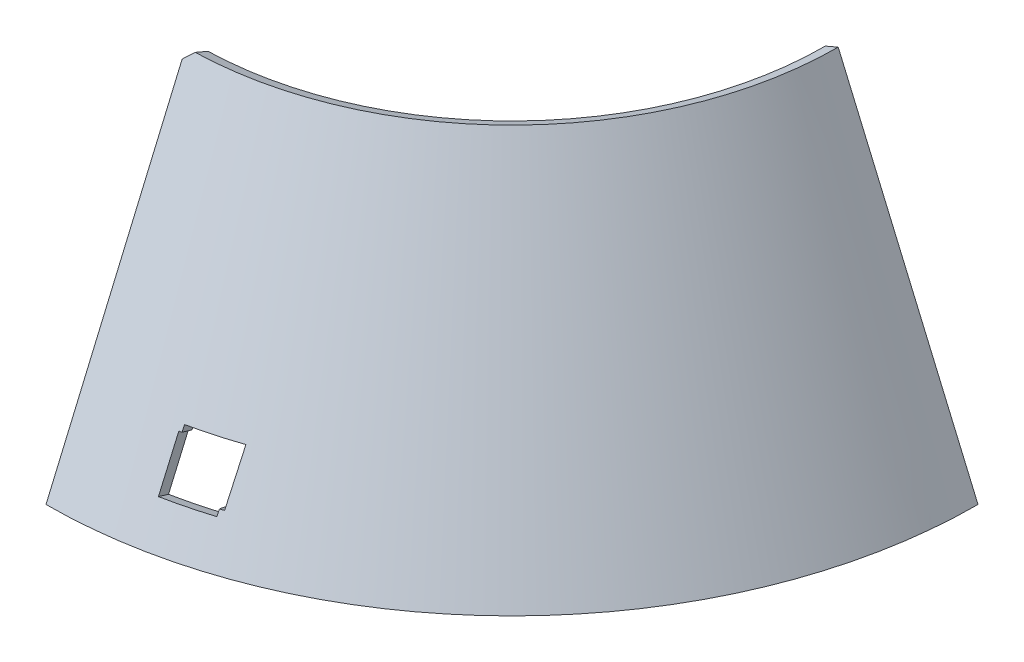
ISO-10303-21;
HEADER;
FILE_DESCRIPTION(('STEP AP214'),'2;1');
FILE_NAME('part.step','',(''),(''),'','','');
FILE_SCHEMA(('AUTOMOTIVE_DESIGN { 1 0 10303 214 1 1 1 1 }'));
ENDSEC;
DATA;
#1=APPLICATION_CONTEXT('core data for automotive mechanical design processes');
#2=APPLICATION_PROTOCOL_DEFINITION('international standard','automotive_design',2000,#1);
#3=PRODUCT_CONTEXT('',#1,'mechanical');
#4=PRODUCT('Part','Part','',(#3));
#5=PRODUCT_RELATED_PRODUCT_CATEGORY('part','',(#4));
#6=PRODUCT_DEFINITION_FORMATION('','',#4);
#7=PRODUCT_DEFINITION_CONTEXT('part definition',#1,'design');
#8=PRODUCT_DEFINITION('design','',#6,#7);
#9=PRODUCT_DEFINITION_SHAPE('','',#8);
#10=(LENGTH_UNIT() NAMED_UNIT(*) SI_UNIT(.MILLI.,.METRE.));
#11=(NAMED_UNIT(*) PLANE_ANGLE_UNIT() SI_UNIT($,.RADIAN.));
#12=(NAMED_UNIT(*) SI_UNIT($,.STERADIAN.) SOLID_ANGLE_UNIT());
#13=UNCERTAINTY_MEASURE_WITH_UNIT(LENGTH_MEASURE(1.E-05),#10,'distance_accuracy_value','');
#14=(GEOMETRIC_REPRESENTATION_CONTEXT(3) GLOBAL_UNCERTAINTY_ASSIGNED_CONTEXT((#13)) GLOBAL_UNIT_ASSIGNED_CONTEXT((#10,
#11,#12)) REPRESENTATION_CONTEXT('',''));
#15=CARTESIAN_POINT('',(0.,0.,0.));
#16=DIRECTION('',(0.,0.,1.));
#17=DIRECTION('',(1.,0.,0.));
#18=AXIS2_PLACEMENT_3D('',#15,#16,#17);
#19=CARTESIAN_POINT('',(0.,-0.590878947868751,0.));
#20=DIRECTION('',(0.,-1.,0.));
#21=DIRECTION('',(0.,0.,-1.));
#22=AXIS2_PLACEMENT_3D('',#19,#20,#21);
#23=CONICAL_SURFACE('',#22,48.6212824549729,0.404891786285083);
#24=DIRECTION('',(0.,-0.919145030018058,0.393919298579168));
#25=VECTOR('',#24,1.);
#26=CARTESIAN_POINT('',(0.,-0.590878947868751,48.6212824549729));
#27=LINE('',#26,#25);
#28=CARTESIAN_POINT('',(0.,-0.590878947868751,48.6212824549729));
#29=VERTEX_POINT('',#28);
#30=CARTESIAN_POINT('',(0.,33.4952973934563,34.0129211658336));
#31=VERTEX_POINT('',#30);
#32=EDGE_CURVE('E315',#29,#31,#27,.F.);
#33=ORIENTED_EDGE('',*,*,#32,.T.);
#34=CARTESIAN_POINT('',(0.988419315799257,34.4091210522747,33.6067502321943));
#35=CARTESIAN_POINT('',(0.947451503015458,34.3714653685382,33.6241002785357));
#36=CARTESIAN_POINT('',(0.906482705954867,34.333781076446,33.6413859051905));
#37=CARTESIAN_POINT('',(0.824483543765227,34.2583006405893,33.6758539424324));
#38=CARTESIAN_POINT('',(0.783453176127035,34.2205044138477,33.6930361653426));
#39=CARTESIAN_POINT('',(0.701330889227328,34.1448001091628,33.7272973949259));
#40=CARTESIAN_POINT('',(0.660238967814638,34.1068919484775,33.744376213611));
#41=CARTESIAN_POINT('',(0.577993588989779,34.0309637754684,33.7784306345839));
#42=CARTESIAN_POINT('',(0.536840129782905,33.9929436806394,33.7954060485809));
#43=CARTESIAN_POINT('',(0.45447169127887,33.9167916391636,33.8292536600035));
#44=CARTESIAN_POINT('',(0.413256710543552,33.8786596102522,33.8461256688439));
#45=CARTESIAN_POINT('',(0.330765244811688,33.8022837002998,33.879766469766));
#46=CARTESIAN_POINT('',(0.289488758733026,33.7640397372375,33.8965350729766));
#47=CARTESIAN_POINT('',(0.206874298428159,33.6874399589331,33.929969062457));
#48=CARTESIAN_POINT('',(0.165536323475866,33.6490840619166,33.9466342595779));
#49=CARTESIAN_POINT('',(0.082798900738112,33.5722604147275,33.9798614366297));
#50=CARTESIAN_POINT('',(0.0413994525809311,33.5337925830288,33.996423227142));
#51=CARTESIAN_POINT('',(0.,33.4952973934563,34.0129211658336));
#52=B_SPLINE_CURVE_WITH_KNOTS('',3,(#34,#35,#36,#37,#38,#39,#40,#41,#42,#43,#44,#45,#46,#47,#48,
#49,#50,#51),.UNSPECIFIED.,.F.,.F.,(4,2,2,2,2,2,2,2,4),(0.,0.174859975601557,0.349975400715504,
0.525347255113729,0.700976514048167,0.876864148256699,1.05301112396914,1.2294184029135,
1.40608694232235),.UNSPECIFIED.);
#53=CARTESIAN_POINT('',(0.988419315801293,34.4091210521313,33.6067502322557));
#54=VERTEX_POINT('',#53);
#55=EDGE_CURVE('E398',#31,#54,#52,.F.);
#56=ORIENTED_EDGE('',*,*,#55,.T.);
#57=CARTESIAN_POINT('',(0.,34.4091210521313,0.));
#58=DIRECTION('',(0.,-1.,0.));
#59=DIRECTION('',(0.,0.,-1.));
#60=AXIS2_PLACEMENT_3D('',#57,#58,#59);
#61=CIRCLE('',#60,33.6212824549729);
#62=CARTESIAN_POINT('',(33.6212824549729,34.4091210521313,0.));
#63=VERTEX_POINT('',#62);
#64=EDGE_CURVE('E312',#54,#63,#61,.F.);
#65=ORIENTED_EDGE('',*,*,#64,.T.);
#66=DIRECTION('',(0.393919298579168,-0.919145030018058,0.));
#67=VECTOR('',#66,1.);
#68=CARTESIAN_POINT('',(48.6212824549729,-0.590878947868751,0.));
#69=LINE('',#68,#67);
#70=CARTESIAN_POINT('',(48.6212824549729,-0.590878947868751,0.));
#71=VERTEX_POINT('',#70);
#72=EDGE_CURVE('E294',#71,#63,#69,.F.);
#73=ORIENTED_EDGE('',*,*,#72,.F.);
#74=CARTESIAN_POINT('',(0.,-0.590878947868751,0.));
#75=DIRECTION('',(0.,-1.,0.));
#76=DIRECTION('',(0.,0.,-1.));
#77=AXIS2_PLACEMENT_3D('',#74,#75,#76);
#78=CIRCLE('',#77,48.6212824549729);
#79=EDGE_CURVE('E320',#29,#71,#78,.F.);
#80=ORIENTED_EDGE('',*,*,#79,.F.);
#81=EDGE_LOOP('',(#33,#56,#65,#73,#80));
#82=FACE_BOUND('',#81,.T.);
#83=CARTESIAN_POINT('',(14.3892419565247,9.08813273793384,42.0809863969922));
#84=CARTESIAN_POINT('',(14.3892418987222,8.63266753267263,42.2872819281315));
#85=CARTESIAN_POINT('',(14.3892418408815,8.17714280551168,42.4934460127009));
#86=CARTESIAN_POINT('',(14.3892417511105,7.26597912359019,42.9055216052493));
#87=CARTESIAN_POINT('',(14.3892417191802,6.81034016883005,43.1114331132292));
#88=CARTESIAN_POINT('',(14.3892417032836,5.59928857812513,43.6583416752893));
#89=CARTESIAN_POINT('',(14.3892417646661,4.84378033374558,43.9991270390677));
#90=CARTESIAN_POINT('',(14.3892419565247,4.08813273793387,44.3396030780588));
#91=B_SPLINE_CURVE_WITH_KNOTS('',3,(#83,#84,#85,#86,#87,#88,#89,#90),.UNSPECIFIED.,.F.,.F.,(4,2,
2,4),(0.,1.50001915418646,3.00003830339338,5.48647042250933),.UNSPECIFIED.);
#92=CARTESIAN_POINT('',(14.3892419565247,9.08813273793385,42.0809863969922));
#93=VERTEX_POINT('',#92);
#94=CARTESIAN_POINT('',(14.3892419565247,4.08813273793386,44.3396030780588));
#95=VERTEX_POINT('',#94);
#96=EDGE_CURVE('E253',#93,#95,#91,.T.);
#97=ORIENTED_EDGE('',*,*,#96,.F.);
#98=CARTESIAN_POINT('',(0.,9.08813273793385,0.));
#99=DIRECTION('',(0.,1.,0.));
#100=DIRECTION('',(0.,0.,1.));
#101=AXIS2_PLACEMENT_3D('',#98,#99,#100);
#102=CIRCLE('',#101,44.4731345896289);
#103=CARTESIAN_POINT('',(9.38924195652468,9.08813273793385,43.4707008881739));
#104=VERTEX_POINT('',#103);
#105=EDGE_CURVE('E419',#104,#93,#102,.T.);
#106=ORIENTED_EDGE('',*,*,#105,.F.);
#107=CARTESIAN_POINT('',(9.38924195652469,9.08813273793385,43.4707008881739));
#108=CARTESIAN_POINT('',(9.38924196121012,8.88422063770312,43.5601070180713));
#109=CARTESIAN_POINT('',(9.38924202003791,8.68030401346425,43.6495028297721));
#110=CARTESIAN_POINT('',(9.38924218290741,8.27120889431544,43.8288234238951));
#111=CARTESIAN_POINT('',(9.38924228722471,8.06603034467455,43.9187480814565));
#112=CARTESIAN_POINT('',(9.38924247695455,7.65441137533327,44.0991263812471));
#113=CARTESIAN_POINT('',(9.38924256224774,7.44797090161439,44.1895799002072));
#114=CARTESIAN_POINT('',(9.38924268026924,7.0338280830525,44.3710159303044));
#115=CARTESIAN_POINT('',(9.38924271267533,6.8261256848741,44.461998319699));
#116=CARTESIAN_POINT('',(9.38924271274447,6.4094590168309,44.6444920966756));
#117=CARTESIAN_POINT('',(9.38924268001572,6.2004946942985,44.7360033640077));
#118=CARTESIAN_POINT('',(9.38924256203233,5.78130417677748,44.9195548998605));
#119=CARTESIAN_POINT('',(9.38924247646387,5.57107792977,45.0115950495816));
#120=CARTESIAN_POINT('',(9.3892422868828,5.14936356296458,45.1962043517149));
#121=CARTESIAN_POINT('',(9.38924218276328,4.93787539178195,45.2887733867457));
#122=CARTESIAN_POINT('',(9.38924201935784,4.51363717485104,45.4744404553772));
#123=CARTESIAN_POINT('',(9.38924196034127,4.30088707832703,45.5675383729586));
#124=CARTESIAN_POINT('',(9.38924195652469,4.08813273793385,45.6606265910253));
#125=B_SPLINE_CURVE_WITH_KNOTS('',3,(#107,#108,#109,#110,#111,#112,#113,#114,#115,#116,#117,
#118,#119,#120,#121,#122,#123,#124),.UNSPECIFIED.,.F.,.F.,(4,2,2,2,2,2,2,2,4),(0.,
0.667953894880127,1.34001202476086,2.01617441138296,2.69644107311311,3.38081202504113,
4.06928727907507,4.76186684403469,5.45855072574312),.UNSPECIFIED.);
#126=CARTESIAN_POINT('',(9.38924202469322,8.49725380080343,43.7297400961966));
#127=VERTEX_POINT('',#126);
#128=EDGE_CURVE('E425',#127,#104,#125,.F.);
#129=ORIENTED_EDGE('',*,*,#128,.F.);
#130=CARTESIAN_POINT('',(0.,8.4972537900651,0.));
#131=DIRECTION('',(0.,-1.,0.));
#132=DIRECTION('',(0.,0.,-1.));
#133=AXIS2_PLACEMENT_3D('',#130,#131,#132);
#134=CIRCLE('',#133,44.7263684244298);
#135=CARTESIAN_POINT('',(9.10846788685826,8.4972537900651,43.7890836304199));
#136=VERTEX_POINT('',#135);
#137=EDGE_CURVE('E162',#136,#127,#134,.F.);
#138=ORIENTED_EDGE('',*,*,#137,.F.);
#139=CARTESIAN_POINT('',(9.10846788685826,8.4972537900651,43.7890836304199));
#140=CARTESIAN_POINT('',(9.10900051380223,8.29317921680716,43.8783054214081));
#141=CARTESIAN_POINT('',(9.10953016555326,8.08910094993685,43.9675187817848));
#142=CARTESIAN_POINT('',(9.11058668360364,7.67972871952296,44.1464571446878));
#143=CARTESIAN_POINT('',(9.11111351483862,7.47443471287128,44.2361820487992));
#144=CARTESIAN_POINT('',(9.11216433369423,7.06263100335318,44.4161435001891));
#145=CARTESIAN_POINT('',(9.11268828632087,6.85612125789684,44.5063799502137));
#146=CARTESIAN_POINT('',(9.11373331539718,6.44188606999111,44.6873644894537));
#147=CARTESIAN_POINT('',(9.11425435707185,6.23416058544909,44.7781124825287));
#148=CARTESIAN_POINT('',(9.11529355055904,5.81749391896376,44.9601201026062));
#149=CARTESIAN_POINT('',(9.11581166792157,5.60855269541419,45.0513796345568));
#150=CARTESIAN_POINT('',(9.11684502015484,5.18945455035161,45.2344103247068));
#151=CARTESIAN_POINT('',(9.11736022101681,4.97929758770514,45.3261813889119));
#152=CARTESIAN_POINT('',(9.1183877667927,4.55776796420889,45.5102351346147));
#153=CARTESIAN_POINT('',(9.11890007824175,4.34639526268804,45.6025177231518));
#154=CARTESIAN_POINT('',(9.11992189634924,3.92243416013489,45.7875945041943));
#155=CARTESIAN_POINT('',(9.12043137021814,3.7098457188759,45.8803886047322));
#156=CARTESIAN_POINT('',(9.12093802924988,3.4972537900651,45.9731747298771));
#157=B_SPLINE_CURVE_WITH_KNOTS('',3,(#139,#140,#141,#142,#143,#144,#145,#146,#147,#148,#149,
#150,#151,#152,#153,#154,#155,#156),.UNSPECIFIED.,.F.,.F.,(4,2,2,2,2,2,2,2,4),(0.,
0.66818050542009,1.34031753394844,2.01641109004187,2.69646117559853,3.38046779002849,
4.06843093032307,4.76035059112299,5.45622676478532),.UNSPECIFIED.);
#158=CARTESIAN_POINT('',(9.12093802924988,3.4972537900651,45.9731747298771));
#159=VERTEX_POINT('',#158);
#160=EDGE_CURVE('E225',#159,#136,#157,.F.);
#161=ORIENTED_EDGE('',*,*,#160,.F.);
#162=CARTESIAN_POINT('',(0.,3.4972537900651,0.));
#163=DIRECTION('',(0.,-1.,0.));
#164=DIRECTION('',(0.,0.,-1.));
#165=AXIS2_PLACEMENT_3D('',#162,#163,#164);
#166=CIRCLE('',#165,46.869225567287);
#167=CARTESIAN_POINT('',(13.978059653915,3.4972537900651,44.7363180602608));
#168=VERTEX_POINT('',#167);
#169=EDGE_CURVE('E233',#168,#159,#166,.T.);
#170=ORIENTED_EDGE('',*,*,#169,.F.);
#171=CARTESIAN_POINT('',(13.978059653915,3.4972537900651,44.7363180602608));
#172=CARTESIAN_POINT('',(13.9772825266304,3.71002650705579,44.6410249522215));
#173=CARTESIAN_POINT('',(13.9765011032,3.92279013671156,44.5457115883687));
#174=CARTESIAN_POINT('',(13.9749340320446,4.34705150386619,44.355602569313));
#175=CARTESIAN_POINT('',(13.974148435948,4.55854934957247,44.2608071551677));
#176=CARTESIAN_POINT('',(13.9725729396628,4.98027915002446,44.0717340460208));
#177=CARTESIAN_POINT('',(13.9717830921819,5.1905112142793,43.9774565948425));
#178=CARTESIAN_POINT('',(13.9701990541689,5.60970944983015,43.7894194100423));
#179=CARTESIAN_POINT('',(13.9694049172006,5.81867573199077,43.6956599231244));
#180=CARTESIAN_POINT('',(13.9678122929924,6.23534240222566,43.5086586617598));
#181=CARTESIAN_POINT('',(13.967013859998,6.44304290255115,43.4154171369644));
#182=CARTESIAN_POINT('',(13.9654126713891,6.85717800746246,43.2294517881076));
#183=CARTESIAN_POINT('',(13.9646099705046,7.0636127257267,43.1367282167316));
#184=CARTESIAN_POINT('',(13.9630003049807,7.47521626587193,42.9517987594643));
#185=CARTESIAN_POINT('',(13.9621933953759,7.68038520289121,42.8595931293623));
#186=CARTESIAN_POINT('',(13.9605754137329,8.08945717619011,42.6756995255844));
#187=CARTESIAN_POINT('',(13.9597643967815,8.29336032913042,42.5840118109354));
#188=CARTESIAN_POINT('',(13.9589488570119,8.4972537900651,42.4923025881766));
#189=B_SPLINE_CURVE_WITH_KNOTS('',3,(#171,#172,#173,#174,#175,#176,#177,#178,#179,#180,#181,
#182,#183,#184,#185,#186,#187,#188),.UNSPECIFIED.,.F.,.F.,(4,2,2,2,2,2,2,2,4),(0.,
0.69941581622366,1.39473094746142,2.08594541206961,2.77305923496353,3.4560724478118,
4.13498508923434,4.80979720500432,5.48050884825414),.UNSPECIFIED.);
#190=CARTESIAN_POINT('',(13.9758897258364,4.08813275968268,44.4716223709653));
#191=VERTEX_POINT('',#190);
#192=EDGE_CURVE('E180',#191,#168,#189,.F.);
#193=ORIENTED_EDGE('',*,*,#192,.F.);
#194=CARTESIAN_POINT('',(0.,4.08813273793385,0.));
#195=DIRECTION('',(0.,-1.,0.));
#196=DIRECTION('',(0.,0.,-1.));
#197=AXIS2_PLACEMENT_3D('',#194,#195,#196);
#198=CIRCLE('',#197,46.6159917324861);
#199=EDGE_CURVE('E422',#95,#191,#198,.T.);
#200=ORIENTED_EDGE('',*,*,#199,.F.);
#201=EDGE_LOOP('',(#97,#106,#129,#138,#161,#170,#193,#200));
#202=FACE_BOUND('',#201,.T.);
#203=ADVANCED_FACE('F45',(#82,#202),#23,.F.);
#204=CARTESIAN_POINT('',(0.,0.,0.));
#205=DIRECTION('',(0.,-1.,0.));
#206=DIRECTION('',(0.,0.,-1.));
#207=AXIS2_PLACEMENT_3D('',#204,#205,#206);
#208=CONICAL_SURFACE('',#207,50.,0.404891786285083);
#209=CARTESIAN_POINT('',(0.,35.,0.));
#210=DIRECTION('',(0.,1.,0.));
#211=DIRECTION('',(0.,0.,1.));
#212=AXIS2_PLACEMENT_3D('',#209,#210,#211);
#213=CIRCLE('',#212,35.);
#214=CARTESIAN_POINT('',(0.988870424110718,35.,34.9860277151368));
#215=VERTEX_POINT('',#214);
#216=CARTESIAN_POINT('',(35.,35.,0.));
#217=VERTEX_POINT('',#216);
#218=EDGE_CURVE('E286',#215,#217,#213,.T.);
#219=ORIENTED_EDGE('',*,*,#218,.F.);
#220=CARTESIAN_POINT('',(0.,34.0859691133839,35.3917275228355));
#221=CARTESIAN_POINT('',(0.0414097053476364,34.1244564865586,35.375232934065));
#222=CARTESIAN_POINT('',(0.0828194067698719,34.162917553988,35.3586769503243));
#223=CARTESIAN_POINT('',(0.16557977240056,34.2397320769515,35.3254653493417));
#224=CARTESIAN_POINT('',(0.206930436937994,34.2780856077415,35.3088099069763));
#225=CARTESIAN_POINT('',(0.289572714569471,34.3546850578516,35.2753993894277));
#226=CARTESIAN_POINT('',(0.330864328306688,34.3929310526474,35.2586444888795));
#227=CARTESIAN_POINT('',(0.413388489394707,34.4693154303761,35.2250350556067));
#228=CARTESIAN_POINT('',(0.454621037704286,34.5074538890032,35.2081806972687));
#229=CARTESIAN_POINT('',(0.537027053245166,34.5836231942394,35.1743723490755));
#230=CARTESIAN_POINT('',(0.578200521750856,34.6216541167583,35.1574185333515));
#231=CARTESIAN_POINT('',(0.660488362919005,34.6976083495101,35.123411271049));
#232=CARTESIAN_POINT('',(0.701602737171895,34.7355317358661,35.1063579983393));
#233=CARTESIAN_POINT('',(0.78377237532151,34.8112708962591,35.0721518227301));
#234=CARTESIAN_POINT('',(0.824827641124643,34.8490867466293,35.0549990934297));
#235=CARTESIAN_POINT('',(0.90687904713024,34.9246108342152,35.0205940053272));
#236=CARTESIAN_POINT('',(0.947875189556367,34.9623191479728,35.0033418198472));
#237=CARTESIAN_POINT('',(0.988870424108839,35.0000000001552,34.9860277150703));
#238=B_SPLINE_CURVE_WITH_KNOTS('',3,(#220,#221,#222,#223,#224,#225,#226,#227,#228,#229,#230,
#231,#232,#233,#234,#235,#236,#237),.UNSPECIFIED.,.F.,.F.,(4,2,2,2,2,2,2,2,4),(0.,
0.17667202604289,0.353093161699171,0.529264292896208,0.705186309548079,0.880860105561118,
1.05628657883917,1.23146663128891,1.40640116882484),.UNSPECIFIED.);
#239=CARTESIAN_POINT('',(0.,34.0859691133839,35.3917275228355));
#240=VERTEX_POINT('',#239);
#241=EDGE_CURVE('E12',#215,#240,#238,.F.);
#242=ORIENTED_EDGE('',*,*,#241,.T.);
#243=DIRECTION('',(0.,0.919145030018058,-0.393919298579168));
#244=VECTOR('',#243,1.);
#245=CARTESIAN_POINT('',(0.,0.,50.));
#246=LINE('',#245,#244);
#247=CARTESIAN_POINT('',(0.,0.,50.));
#248=VERTEX_POINT('',#247);
#249=EDGE_CURVE('E295',#248,#240,#246,.T.);
#250=ORIENTED_EDGE('',*,*,#249,.F.);
#251=CARTESIAN_POINT('',(0.,0.,0.));
#252=DIRECTION('',(0.,1.,0.));
#253=DIRECTION('',(0.,0.,1.));
#254=AXIS2_PLACEMENT_3D('',#251,#252,#253);
#255=CIRCLE('',#254,50.);
#256=CARTESIAN_POINT('',(50.,0.,0.));
#257=VERTEX_POINT('',#256);
#258=EDGE_CURVE('E301',#248,#257,#255,.T.);
#259=ORIENTED_EDGE('',*,*,#258,.T.);
#260=DIRECTION('',(-0.393919298579168,0.919145030018058,0.));
#261=VECTOR('',#260,1.);
#262=CARTESIAN_POINT('',(50.,0.,0.));
#263=LINE('',#262,#261);
#264=EDGE_CURVE('E242',#257,#217,#263,.T.);
#265=ORIENTED_EDGE('',*,*,#264,.T.);
#266=EDGE_LOOP('',(#219,#242,#250,#259,#265));
#267=FACE_BOUND('',#266,.T.);
#268=CARTESIAN_POINT('',(0.,9.6790116858026,0.));
#269=DIRECTION('',(0.,-1.,0.));
#270=DIRECTION('',(0.,0.,-1.));
#271=AXIS2_PLACEMENT_3D('',#268,#269,#270);
#272=CIRCLE('',#271,45.851852134656);
#273=CARTESIAN_POINT('',(9.6803190919552,9.67901168580261,44.8183418530437));
#274=VERTEX_POINT('',#273);
#275=CARTESIAN_POINT('',(14.8353247552336,9.6790116858026,43.3855446385673));
#276=VERTEX_POINT('',#275);
#277=EDGE_CURVE('E252',#274,#276,#272,.F.);
#278=ORIENTED_EDGE('',*,*,#277,.T.);
#279=CARTESIAN_POINT('',(14.8353247552336,9.67901168580259,43.3855446385673));
#280=CARTESIAN_POINT('',(14.8333678652486,9.22380177185407,43.5923936451277));
#281=CARTESIAN_POINT('',(14.8314363969811,8.76852703720864,43.7991002027128));
#282=CARTESIAN_POINT('',(14.8276225382814,7.85785327036241,44.2122397830105));
#283=CARTESIAN_POINT('',(14.8257401478491,7.40245423816211,44.4186728057244));
#284=CARTESIAN_POINT('',(14.8207968375962,6.19116077923862,44.9673335106239));
#285=CARTESIAN_POINT('',(14.8177774094461,5.43516202975971,45.3093312759656));
#286=CARTESIAN_POINT('',(14.8148190944937,4.67901168580263,45.6509940070359));
#287=B_SPLINE_CURVE_WITH_KNOTS('',3,(#279,#280,#281,#282,#283,#284,#285,#286),.UNSPECIFIED.,.F.,
.F.,(4,2,2,4),(0.,1.50001916679456,3.0000383275242,5.48932522688761),.UNSPECIFIED.);
#288=CARTESIAN_POINT('',(14.8148190944937,4.67901168580261,45.650994007036));
#289=VERTEX_POINT('',#288);
#290=EDGE_CURVE('E245',#276,#289,#287,.T.);
#291=ORIENTED_EDGE('',*,*,#290,.T.);
#292=CARTESIAN_POINT('',(0.,4.6790116858026,0.));
#293=DIRECTION('',(0.,-1.,0.));
#294=DIRECTION('',(0.,0.,-1.));
#295=AXIS2_PLACEMENT_3D('',#292,#293,#294);
#296=CIRCLE('',#295,47.9947092775132);
#297=CARTESIAN_POINT('',(14.3892419399735,4.67901168580259,45.7869177279484));
#298=VERTEX_POINT('',#297);
#299=EDGE_CURVE('E154',#289,#298,#296,.T.);
#300=ORIENTED_EDGE('',*,*,#299,.T.);
#301=CARTESIAN_POINT('',(14.3892419565247,9.08813273793385,43.8021536932558));
#302=CARTESIAN_POINT('',(14.3892419631333,8.88424016073175,43.8941304240074));
#303=CARTESIAN_POINT('',(14.3892420462764,8.68033700083951,43.9860836946436));
#304=CARTESIAN_POINT('',(14.389242276491,8.27126502399851,44.1705054142312));
#305=CARTESIAN_POINT('',(14.3892424239497,8.06609607990077,44.2629735811498));
#306=CARTESIAN_POINT('',(14.3892426921842,7.65449253609231,44.448425141001));
#307=CARTESIAN_POINT('',(14.3892428127927,7.44805781094628,44.5414082555328));
#308=CARTESIAN_POINT('',(14.3892429797168,7.03392270248801,44.7278897439131));
#309=CARTESIAN_POINT('',(14.38924302558,6.82622219538462,44.8213878428475));
#310=CARTESIAN_POINT('',(14.3892430257641,6.4095555216559,45.00889933007));
#311=CARTESIAN_POINT('',(14.3892429795346,6.2005892328473,45.1029124468554));
#312=CARTESIAN_POINT('',(14.3892428127771,5.78139099385692,45.2914539931282));
#313=CARTESIAN_POINT('',(14.3892426918081,5.57115892305457,45.3859821544302));
#314=CARTESIAN_POINT('',(14.3892424237462,5.14942911926541,45.5755538098045));
#315=CARTESIAN_POINT('',(14.3892422765028,4.93793126718612,45.6705970389369));
#316=CARTESIAN_POINT('',(14.3892420454079,4.51366989659029,45.8611988374013));
#317=CARTESIAN_POINT('',(14.3892419619349,4.30090626044953,45.9567571449134));
#318=CARTESIAN_POINT('',(14.3892419565247,4.08813273793385,46.0522934335054));
#319=B_SPLINE_CURVE_WITH_KNOTS('',3,(#301,#302,#303,#304,#305,#306,#307,#308,#309,#310,#311,
#312,#313,#314,#315,#316,#317,#318),.UNSPECIFIED.,.F.,.F.,(4,2,2,2,2,2,2,2,4),(0.,
0.671034362677894,1.34616539429251,2.02539318409684,2.70871781331681,3.39613935537739,
4.08765787612404,4.78327343403969,5.48298608045744),.UNSPECIFIED.);
#320=CARTESIAN_POINT('',(14.3892419565247,4.08813273793385,46.0522934335054));
#321=VERTEX_POINT('',#320);
#322=EDGE_CURVE('E171',#298,#321,#319,.T.);
#323=ORIENTED_EDGE('',*,*,#322,.T.);
#324=CARTESIAN_POINT('',(0.,4.08813273793385,0.));
#325=DIRECTION('',(0.,-1.,0.));
#326=DIRECTION('',(0.,0.,-1.));
#327=AXIS2_PLACEMENT_3D('',#324,#325,#326);
#328=CIRCLE('',#327,48.2479431123141);
#329=CARTESIAN_POINT('',(9.38924195652469,4.08813273793386,47.3255338062967));
#330=VERTEX_POINT('',#329);
#331=EDGE_CURVE('E173',#321,#330,#328,.T.);
#332=ORIENTED_EDGE('',*,*,#331,.T.);
#333=CARTESIAN_POINT('',(9.38924195652468,4.08813273793385,47.3255338062967));
#334=CARTESIAN_POINT('',(9.38924195984115,4.30072498360668,47.2326470223106));
#335=CARTESIAN_POINT('',(9.38924201092475,4.51331342733454,47.1397515366458));
#336=CARTESIAN_POINT('',(9.38924215236574,4.93727453115796,46.9544708004163));
#337=CARTESIAN_POINT('',(9.3892422424983,5.14864723510601,46.8620856501951));
#338=CARTESIAN_POINT('',(9.38924240660965,5.57017685983323,46.6778255861946));
#339=CARTESIAN_POINT('',(9.38924248067781,5.78033382497123,46.5859507738946));
#340=CARTESIAN_POINT('',(9.38924258281182,6.19943197130186,46.4027113822932));
#341=CARTESIAN_POINT('',(9.38924261113963,6.40837319737986,46.311346905652));
#342=CARTESIAN_POINT('',(9.38924261108467,6.82503986515249,46.1291281806229));
#343=CARTESIAN_POINT('',(9.38924258302881,7.03276535227071,46.038274036102));
#344=CARTESIAN_POINT('',(9.38924248086656,7.44700054148257,45.8570759679923));
#345=CARTESIAN_POINT('',(9.3892424070289,7.65351028955325,45.7667321495113));
#346=CARTESIAN_POINT('',(9.38924224279229,8.06531400041956,45.5865547248546));
#347=CARTESIAN_POINT('',(9.38924215249273,8.27060800975791,45.4967212250547));
#348=CARTESIAN_POINT('',(9.3892420114949,8.67998024147451,45.3175644236806));
#349=CARTESIAN_POINT('',(9.38924196056678,8.88405851098458,45.2282412298023));
#350=CARTESIAN_POINT('',(9.38924195652469,9.08813273793385,45.1389088008655));
#351=B_SPLINE_CURVE_WITH_KNOTS('',3,(#333,#334,#335,#336,#337,#338,#339,#340,#341,#342,#343,
#344,#345,#346,#347,#348,#349,#350),.UNSPECIFIED.,.F.,.F.,(4,2,2,2,2,2,2,2,4),(0.,
0.695996234059649,1.38803736181103,2.07612338771972,2.76025431874322,3.44043016440448,
4.11665093686667,4.78891665100941,5.45722732450641),.UNSPECIFIED.);
#352=CARTESIAN_POINT('',(9.38924195652468,9.08813273793385,45.1389088008655));
#353=VERTEX_POINT('',#352);
#354=EDGE_CURVE('E170',#330,#353,#351,.T.);
#355=ORIENTED_EDGE('',*,*,#354,.T.);
#356=CARTESIAN_POINT('',(0.,9.08813273793385,0.));
#357=DIRECTION('',(0.,1.,0.));
#358=DIRECTION('',(0.,0.,1.));
#359=AXIS2_PLACEMENT_3D('',#356,#357,#358);
#360=CIRCLE('',#359,46.1050859694569);
#361=CARTESIAN_POINT('',(9.67867112063248,9.08813274961033,45.0777359691042));
#362=VERTEX_POINT('',#361);
#363=EDGE_CURVE('E159',#353,#362,#360,.T.);
#364=ORIENTED_EDGE('',*,*,#363,.T.);
#365=CARTESIAN_POINT('',(9.66693877555308,4.67901168580259,47.0110881956876));
#366=CARTESIAN_POINT('',(9.66748195322669,4.89176640604012,46.9178881178634));
#367=CARTESIAN_POINT('',(9.6680283623525,5.10451650566308,46.8246775109335));
#368=CARTESIAN_POINT('',(9.66912445516778,5.52875472423632,46.6387836976307));
#369=CARTESIAN_POINT('',(9.6696741006371,5.74024289846376,46.5461006171832));
#370=CARTESIAN_POINT('',(9.67077659850457,6.16195726686092,46.3612618463099));
#371=CARTESIAN_POINT('',(9.67132941263072,6.37218351699747,46.2691062833457));
#372=CARTESIAN_POINT('',(9.67243821054132,6.79137403615935,46.0853225307582));
#373=CARTESIAN_POINT('',(9.67299415582012,7.00033836186934,45.9936944701942));
#374=CARTESIAN_POINT('',(9.6741092006019,7.41700503157928,45.8109657041909));
#375=CARTESIAN_POINT('',(9.67466826123058,7.62470743299806,45.7198651294436));
#376=CARTESIAN_POINT('',(9.67578954606072,8.03885025325204,45.5381913136423));
#377=CARTESIAN_POINT('',(9.67635173086319,8.24529073026149,45.4476182049591));
#378=CARTESIAN_POINT('',(9.67747929482509,8.65690970135075,45.2669992983263));
#379=CARTESIAN_POINT('',(9.67804463392133,8.86208825437737,45.1769536344629));
#380=CARTESIAN_POINT('',(9.67917856901732,9.27118337521516,44.9973895874966));
#381=CARTESIAN_POINT('',(9.67974712408374,9.47510000277847,44.9078713402664));
#382=CARTESIAN_POINT('',(9.6803190919552,9.67901168580262,44.8183418530437));
#383=B_SPLINE_CURVE_WITH_KNOTS('',3,(#365,#366,#367,#368,#369,#370,#371,#372,#373,#374,#375,
#376,#377,#378,#379,#380,#381,#382),.UNSPECIFIED.,.F.,.F.,(4,2,2,2,2,2,2,2,4),(0.,
0.696821415037625,1.38954020964459,2.07815640530714,2.76267002678753,3.44308110222452,
4.11938966323595,4.79159574502325,5.45969938647827),.UNSPECIFIED.);
#384=EDGE_CURVE('E143',#362,#274,#383,.T.);
#385=ORIENTED_EDGE('',*,*,#384,.T.);
#386=EDGE_LOOP('',(#278,#291,#300,#323,#332,#355,#364,#385));
#387=FACE_BOUND('',#386,.T.);
#388=ADVANCED_FACE('F168',(#267,#387),#208,.T.);
#389=CARTESIAN_POINT('',(0.,0.,50.));
#390=DIRECTION('',(1.,0.,0.));
#391=DIRECTION('',(0.,0.919145030018058,-0.393919298579168));
#392=AXIS2_PLACEMENT_3D('',#389,#390,#391);
#393=PLANE('',#392);
#394=ORIENTED_EDGE('',*,*,#249,.T.);
#395=CARTESIAN_POINT('',(0.,33.46017681764,33.9309376604497));
#396=CARTESIAN_POINT('',(0.,33.6787041545542,34.441056170322));
#397=CARTESIAN_POINT('',(0.,33.8972350976488,34.9511731377513));
#398=CARTESIAN_POINT('',(0.,34.115769198426,35.4612887512845));
#399=B_SPLINE_CURVE_WITH_KNOTS('',3,(#395,#396,#397,#398),.UNSPECIFIED.,.F.,.F.,(4,4),
(0.0353536681532191,0.0370185332589188),.UNSPECIFIED.);
#400=EDGE_CURVE('E310',#240,#31,#399,.F.);
#401=ORIENTED_EDGE('',*,*,#400,.T.);
#402=ORIENTED_EDGE('',*,*,#32,.F.);
#403=DIRECTION('',(0.,-0.393919298579168,-0.919145030018058));
#404=VECTOR('',#403,1.);
#405=CARTESIAN_POINT('',(0.,0.,50.));
#406=LINE('',#405,#404);
#407=EDGE_CURVE('E307',#248,#29,#406,.T.);
#408=ORIENTED_EDGE('',*,*,#407,.F.);
#409=EDGE_LOOP('',(#394,#401,#402,#408));
#410=FACE_BOUND('',#409,.T.);
#411=ADVANCED_FACE('F332',(#410),#393,.F.);
#412=CARTESIAN_POINT('',(0.,35.,0.));
#413=DIRECTION('',(0.,1.,0.));
#414=DIRECTION('',(0.,0.,1.));
#415=AXIS2_PLACEMENT_3D('',#412,#413,#414);
#416=CONICAL_SURFACE('',#415,35.,1.16590454050981);
#417=ORIENTED_EDGE('',*,*,#64,.F.);
#418=CARTESIAN_POINT('',(0.988895982683637,35.0349142284441,35.0675259869295));
#419=CARTESIAN_POINT('',(0.988736373755649,34.8163801276669,34.5574148744619));
#420=CARTESIAN_POINT('',(0.988569901597237,34.5978491845723,34.0473026980231));
#421=CARTESIAN_POINT('',(0.98839559521521,34.3793218476581,33.5371893251101));
#422=B_SPLINE_CURVE_WITH_KNOTS('',3,(#418,#419,#420,#421),.UNSPECIFIED.,.F.,.F.,(4,4),
(0.0353536681532191,0.0370185332589188),.UNSPECIFIED.);
#423=EDGE_CURVE('E58',#54,#215,#422,.F.);
#424=ORIENTED_EDGE('',*,*,#423,.T.);
#425=ORIENTED_EDGE('',*,*,#218,.T.);
#426=DIRECTION('',(-0.919145030018058,-0.393919298579168,0.));
#427=VECTOR('',#426,1.);
#428=CARTESIAN_POINT('',(35.,35.,0.));
#429=LINE('',#428,#427);
#430=EDGE_CURVE('E304',#217,#63,#429,.T.);
#431=ORIENTED_EDGE('',*,*,#430,.T.);
#432=EDGE_LOOP('',(#417,#424,#425,#431));
#433=FACE_BOUND('',#432,.T.);
#434=ADVANCED_FACE('F341',(#433),#416,.F.);
#435=CARTESIAN_POINT('',(50.,0.,0.));
#436=DIRECTION('',(0.,0.,-1.));
#437=DIRECTION('',(-0.393919298579168,0.919145030018058,0.));
#438=AXIS2_PLACEMENT_3D('',#435,#436,#437);
#439=PLANE('',#438);
#440=ORIENTED_EDGE('',*,*,#430,.F.);
#441=ORIENTED_EDGE('',*,*,#264,.F.);
#442=DIRECTION('',(-0.919145030018058,-0.393919298579168,0.));
#443=VECTOR('',#442,1.);
#444=CARTESIAN_POINT('',(50.,0.,0.));
#445=LINE('',#444,#443);
#446=EDGE_CURVE('E308',#257,#71,#445,.T.);
#447=ORIENTED_EDGE('',*,*,#446,.T.);
#448=ORIENTED_EDGE('',*,*,#72,.T.);
#449=EDGE_LOOP('',(#440,#441,#447,#448));
#450=FACE_BOUND('',#449,.T.);
#451=ADVANCED_FACE('F346',(#450),#439,.T.);
#452=CARTESIAN_POINT('',(0.,0.,0.));
#453=DIRECTION('',(0.,1.,0.));
#454=DIRECTION('',(0.,0.,1.));
#455=AXIS2_PLACEMENT_3D('',#452,#453,#454);
#456=CONICAL_SURFACE('',#455,50.,1.16590454050981);
#457=ORIENTED_EDGE('',*,*,#258,.F.);
#458=ORIENTED_EDGE('',*,*,#407,.T.);
#459=ORIENTED_EDGE('',*,*,#79,.T.);
#460=ORIENTED_EDGE('',*,*,#446,.F.);
#461=EDGE_LOOP('',(#457,#458,#459,#460));
#462=FACE_BOUND('',#461,.T.);
#463=ADVANCED_FACE('F344',(#462),#456,.T.);
#464=CARTESIAN_POINT('',(0.,34.115769198426,35.4612887512845));
#465=CARTESIAN_POINT('',(0.,33.8972350976488,34.9511731377513));
#466=CARTESIAN_POINT('',(0.,33.6787041545542,34.441056170322));
#467=CARTESIAN_POINT('',(0.,33.46017681764,33.9309376604497));
#468=CARTESIAN_POINT('',(0.988895982683637,35.0349142284441,35.0675259869295));
#469=CARTESIAN_POINT('',(0.988736373755649,34.8163801276669,34.5574148744619));
#470=CARTESIAN_POINT('',(0.988569901597237,34.5978491845723,34.0473026980231));
#471=CARTESIAN_POINT('',(0.98839559521521,34.3793218476581,33.5371893251101));
#472=B_SPLINE_SURFACE_WITH_KNOTS('',1,3,((#464,#465,#466,#467),(#468,#469,#470,#471)),
.UNSPECIFIED.,.F.,.F.,.F.,(2,2),(4,4),(0.,1.),(0.0353536681532191,0.0370185332589188),.UNSPECIFIED.);
#473=ORIENTED_EDGE('',*,*,#241,.F.);
#474=ORIENTED_EDGE('',*,*,#423,.F.);
#475=ORIENTED_EDGE('',*,*,#55,.F.);
#476=ORIENTED_EDGE('',*,*,#400,.F.);
#477=EDGE_LOOP('',(#473,#474,#475,#476));
#478=FACE_BOUND('',#477,.T.);
#479=ADVANCED_FACE('F47',(#478),#472,.T.);
#480=CARTESIAN_POINT('',(0.,4.08813273793385,0.));
#481=DIRECTION('',(0.,1.,0.));
#482=DIRECTION('',(0.,0.,1.));
#483=AXIS2_PLACEMENT_3D('',#480,#481,#482);
#484=CONICAL_SURFACE('',#483,46.6159917324861,1.16590454050981);
#485=CARTESIAN_POINT('',(13.9758901562509,4.08813278143152,44.4716222888952));
#486=CARTESIAN_POINT('',(14.0103365159623,4.13737323206153,44.5812314489228));
#487=CARTESIAN_POINT('',(14.044782875673,4.18661368269152,44.6908406089507));
#488=CARTESIAN_POINT('',(14.1136755950932,4.28509458395151,44.9100589290068));
#489=CARTESIAN_POINT('',(14.1481219548025,4.33433503458149,45.0196680890351));
#490=CARTESIAN_POINT('',(14.2514595174843,4.48205421874184,45.3484907437582));
#491=CARTESIAN_POINT('',(14.3203507204547,4.58053295227219,45.5677042384536));
#492=CARTESIAN_POINT('',(14.3892419234224,4.67901168580259,45.7869177331499));
#493=B_SPLINE_CURVE_WITH_KNOTS('',3,(#485,#486,#487,#488,#489,#490,#491,#492),.UNSPECIFIED.,.F.,
.F.,(4,2,2,4),(0.,0.375004099628533,0.750008199257073,1.4999998895772),.UNSPECIFIED.);
#494=EDGE_CURVE('E164',#191,#298,#493,.T.);
#495=ORIENTED_EDGE('',*,*,#494,.T.);
#496=ORIENTED_EDGE('',*,*,#299,.F.);
#497=DIRECTION('',(0.283718091979369,0.393919298579168,0.874260619318109));
#498=VECTOR('',#497,1.);
#499=CARTESIAN_POINT('',(14.3892419565247,4.08813273793385,44.3396030780588));
#500=LINE('',#499,#498);
#501=EDGE_CURVE('E234',#95,#289,#500,.T.);
#502=ORIENTED_EDGE('',*,*,#501,.F.);
#503=ORIENTED_EDGE('',*,*,#199,.T.);
#504=EDGE_LOOP('',(#495,#496,#502,#503));
#505=FACE_BOUND('',#504,.T.);
#506=ADVANCED_FACE('F266',(#505),#484,.F.);
#507=CARTESIAN_POINT('',(9.38924195652469,4.08813273793384,45.6606265910253));
#508=CARTESIAN_POINT('',(9.38924195652469,5.75507133421291,44.9312767742436));
#509=CARTESIAN_POINT('',(9.38924195652468,7.42175666041345,44.2013306101148));
#510=CARTESIAN_POINT('',(9.38924195652468,9.08813273793387,43.4707008881739));
#511=CARTESIAN_POINT('',(9.66693877555307,4.67901168580259,47.0110881956876));
#512=CARTESIAN_POINT('',(9.67119455192613,6.34595030181986,46.2808632505645));
#513=CARTESIAN_POINT('',(9.67564489957728,8.0126356295096,45.5499811450559));
#514=CARTESIAN_POINT('',(9.6803190919552,9.67901168580262,44.8183418530437));
#515=B_SPLINE_SURFACE_WITH_KNOTS('',1,3,((#507,#508,#509,#510),(#511,#512,#513,#514)),
.UNSPECIFIED.,.F.,.F.,.F.,(2,2),(4,4),(0.,1.),(0.0613480728319962,0.0668066053456272),.UNSPECIFIED.);
#516=CARTESIAN_POINT('',(9.67867104284524,9.08813276127385,45.0777360136594));
#517=CARTESIAN_POINT('',(9.65455182983185,9.03889259873339,44.9654024534143));
#518=CARTESIAN_POINT('',(9.63043261681819,8.98965243619293,44.8530688931693));
#519=CARTESIAN_POINT('',(9.58219419079032,8.89117211111201,44.6284017726793));
#520=CARTESIAN_POINT('',(9.55807497777611,8.84193194857155,44.5160682124344));
#521=CARTESIAN_POINT('',(9.48571782868374,8.69421246120131,44.1790698136128));
#522=CARTESIAN_POINT('',(9.43747989260476,8.59573313637152,43.9544049750364));
#523=CARTESIAN_POINT('',(9.38924195652468,8.49725381154172,43.7297401364602));
#524=B_SPLINE_CURVE_WITH_KNOTS('',3,(#516,#517,#518,#519,#520,#521,#522,#523),.UNSPECIFIED.,.F.,
.F.,(4,2,2,4),(0.,0.375001905603998,0.750003811207999,1.50000000473033),.UNSPECIFIED.);
#525=EDGE_CURVE('E146',#362,#127,#524,.T.);
#526=DIRECTION('',(0.194051423620345,0.393919298579168,0.898427309913169));
#527=VECTOR('',#526,1.);
#528=CARTESIAN_POINT('',(9.38924195652468,9.08813273793385,43.4707008881739));
#529=LINE('',#528,#527);
#530=EDGE_CURVE('E149',#104,#274,#529,.T.);
#531=ORIENTED_EDGE('',*,*,#525,.T.);
#532=ORIENTED_EDGE('',*,*,#128,.T.);
#533=ORIENTED_EDGE('',*,*,#530,.T.);
#534=ORIENTED_EDGE('',*,*,#384,.F.);
#535=EDGE_LOOP('',(#531,#532,#533,#534));
#536=FACE_BOUND('',#535,.T.);
#537=ADVANCED_FACE('F145',(#536),#515,.F.);
#538=CARTESIAN_POINT('',(0.,9.08813273793385,0.));
#539=DIRECTION('',(0.,1.,0.));
#540=DIRECTION('',(0.,0.,1.));
#541=AXIS2_PLACEMENT_3D('',#538,#539,#540);
#542=CONICAL_SURFACE('',#541,44.4731345896289,1.16590454050981);
#543=ORIENTED_EDGE('',*,*,#530,.F.);
#544=ORIENTED_EDGE('',*,*,#105,.T.);
#545=DIRECTION('',(0.297388532472618,0.393919298579168,0.869705494383403));
#546=VECTOR('',#545,1.);
#547=CARTESIAN_POINT('',(14.3892419565247,9.08813273793385,42.0809863969922));
#548=LINE('',#547,#546);
#549=EDGE_CURVE('E153',#93,#276,#548,.T.);
#550=ORIENTED_EDGE('',*,*,#549,.T.);
#551=ORIENTED_EDGE('',*,*,#277,.F.);
#552=EDGE_LOOP('',(#543,#544,#550,#551));
#553=FACE_BOUND('',#552,.T.);
#554=ADVANCED_FACE('F264',(#553),#542,.T.);
#555=CARTESIAN_POINT('',(14.3847811285376,9.08222394845515,42.0679408145764));
#556=CARTESIAN_POINT('',(14.3848527412279,7.41632346715171,42.8224595068725));
#557=CARTESIAN_POINT('',(14.3849209471864,5.74960081937304,43.5752333032329));
#558=CARTESIAN_POINT('',(14.384986185145,4.08222394845519,44.326489168769));
#559=CARTESIAN_POINT('',(14.3892419565247,9.08813273793384,42.0809863969922));
#560=CARTESIAN_POINT('',(14.3892419565247,7.4222322572011,42.8355295763913));
#561=CARTESIAN_POINT('',(14.3892419565247,5.7555096093665,43.5883260410419));
#562=CARTESIAN_POINT('',(14.3892419565247,4.08813273793387,44.3396030780588));
#563=CARTESIAN_POINT('',(14.8353247552336,9.67901168580259,43.3855446385673));
#564=CARTESIAN_POINT('',(14.8281634862028,8.01311126214005,44.1425365282717));
#565=CARTESIAN_POINT('',(14.8213428903512,6.3463886087131,44.8975998219394));
#566=CARTESIAN_POINT('',(14.8148190944937,4.67901168580263,45.6509940070359));
#567=B_SPLINE_SURFACE_WITH_KNOTS('',1,3,((#555,#556,#557,#558),(#559,#560,#561,#562),(#563,#564,
#565,#566)),.UNSPECIFIED.,.F.,.F.,.F.,(2,1,2),(4,4),(-0.01,0.,1.),(0.0627612848050853,
0.0682450111993894),.UNSPECIFIED.);
#568=ORIENTED_EDGE('',*,*,#96,.T.);
#569=ORIENTED_EDGE('',*,*,#501,.T.);
#570=ORIENTED_EDGE('',*,*,#290,.F.);
#571=ORIENTED_EDGE('',*,*,#549,.F.);
#572=EDGE_LOOP('',(#568,#569,#570,#571));
#573=FACE_BOUND('',#572,.T.);
#574=ADVANCED_FACE('F258',(#573),#567,.F.);
#575=CARTESIAN_POINT('',(13.9546459260168,8.49134500058641,42.4792040771258));
#576=CARTESIAN_POINT('',(13.9613761954464,6.82535528242743,43.2285276143787));
#577=CARTESIAN_POINT('',(13.9677972914956,5.15864213979067,43.976456045661));
#578=CARTESIAN_POINT('',(13.9739478308889,3.49134500058642,44.7231583065284));
#579=CARTESIAN_POINT('',(13.9589488570119,8.4972537900651,42.4923025881766));
#580=CARTESIAN_POINT('',(13.9656124901106,6.83126407234712,43.2416480156219));
#581=CARTESIAN_POINT('',(13.9719700109514,5.16455092967581,43.9895967718532));
#582=CARTESIAN_POINT('',(13.978059653915,3.4972537900651,44.7363180602608));
#583=CARTESIAN_POINT('',(14.3892419565247,9.08813273793385,43.8021536932558));
#584=CARTESIAN_POINT('',(14.3892419565247,7.42214306431597,44.55368813995));
#585=CARTESIAN_POINT('',(14.3892419565247,5.75542991818955,45.3036693910774));
#586=CARTESIAN_POINT('',(14.3892419565247,4.08813273793386,46.0522934335054));
#587=B_SPLINE_SURFACE_WITH_KNOTS('',1,3,((#575,#576,#577,#578),(#579,#580,#581,#582),(#583,#584,
#585,#586)),.UNSPECIFIED.,.F.,.F.,.F.,(2,1,2),(4,4),(-0.01,0.,1.),(0.0651916438161211,
0.070672386708094),.UNSPECIFIED.);
#588=DIRECTION('',(0.274121535073097,0.393919298579168,0.87731691549637));
#589=VECTOR('',#588,1.);
#590=CARTESIAN_POINT('',(14.3892419565247,4.08813273793385,46.0522934335054));
#591=LINE('',#590,#589);
#592=EDGE_CURVE('E65',#321,#168,#591,.F.);
#593=ORIENTED_EDGE('',*,*,#192,.T.);
#594=ORIENTED_EDGE('',*,*,#592,.F.);
#595=ORIENTED_EDGE('',*,*,#322,.F.);
#596=ORIENTED_EDGE('',*,*,#494,.F.);
#597=EDGE_LOOP('',(#593,#594,#595,#596));
#598=FACE_BOUND('',#597,.T.);
#599=ADVANCED_FACE('F201',(#598),#587,.F.);
#600=CARTESIAN_POINT('',(0.,9.08813273793385,0.));
#601=DIRECTION('',(0.,1.,0.));
#602=DIRECTION('',(0.,0.,1.));
#603=AXIS2_PLACEMENT_3D('',#600,#601,#602);
#604=CONICAL_SURFACE('',#603,46.1050859694569,1.16590454050981);
#605=ORIENTED_EDGE('',*,*,#363,.F.);
#606=DIRECTION('',(0.187182713110953,0.393919298579168,0.899883446963727));
#607=VECTOR('',#606,1.);
#608=CARTESIAN_POINT('',(9.38924195652468,9.08813273793385,45.1389088008655));
#609=LINE('',#608,#607);
#610=EDGE_CURVE('E165',#353,#136,#609,.F.);
#611=ORIENTED_EDGE('',*,*,#610,.T.);
#612=ORIENTED_EDGE('',*,*,#137,.T.);
#613=ORIENTED_EDGE('',*,*,#525,.F.);
#614=EDGE_LOOP('',(#605,#611,#612,#613));
#615=FACE_BOUND('',#614,.T.);
#616=ADVANCED_FACE('F157',(#615),#604,.T.);
#617=CARTESIAN_POINT('',(9.11825498997714,3.49134500058642,45.9596511391129));
#618=CARTESIAN_POINT('',(9.11424258272356,5.1582551544044,45.2321331371185));
#619=CARTESIAN_POINT('',(9.11005287114058,6.82493729751908,44.5041329629295));
#620=CARTESIAN_POINT('',(9.10566014616159,8.49134500058642,43.7755853787154));
#621=CARTESIAN_POINT('',(9.12093802924988,3.49725379006511,45.9731747298771));
#622=CARTESIAN_POINT('',(9.11696534880079,5.16416394403987,45.2456488461371));
#623=CARTESIAN_POINT('',(9.11281711951072,6.83084608716324,44.5176402613017));
#624=CARTESIAN_POINT('',(9.10846788685825,8.49725379006511,43.7890836304199));
#625=CARTESIAN_POINT('',(9.38924195652469,4.08813273793386,47.3255338062967));
#626=CARTESIAN_POINT('',(9.38924195652469,5.75504290758667,46.5972197479892));
#627=CARTESIAN_POINT('',(9.38924195652468,7.42172505157945,45.8683700985152));
#628=CARTESIAN_POINT('',(9.38924195652468,9.08813273793386,45.1389088008655));
#629=B_SPLINE_SURFACE_WITH_KNOTS('',1,3,((#617,#618,#619,#620),(#621,#622,#623,#624),(#625,#626,
#627,#628)),.UNSPECIFIED.,.F.,.F.,.F.,(2,1,2),(4,4),(-0.01,0.,1.),(0.0634026690813971,
0.0688598801744501),.UNSPECIFIED.);
#630=DIRECTION('',(0.178869284849867,0.393919298579168,0.901572717613057));
#631=VECTOR('',#630,1.);
#632=CARTESIAN_POINT('',(9.38924195652469,4.08813273793385,47.3255338062967));
#633=LINE('',#632,#631);
#634=EDGE_CURVE('E70',#330,#159,#633,.F.);
#635=ORIENTED_EDGE('',*,*,#610,.F.);
#636=ORIENTED_EDGE('',*,*,#354,.F.);
#637=ORIENTED_EDGE('',*,*,#634,.T.);
#638=ORIENTED_EDGE('',*,*,#160,.T.);
#639=EDGE_LOOP('',(#635,#636,#637,#638));
#640=FACE_BOUND('',#639,.T.);
#641=ADVANCED_FACE('F200',(#640),#629,.F.);
#642=CARTESIAN_POINT('',(0.,4.08813273793385,0.));
#643=DIRECTION('',(0.,1.,0.));
#644=DIRECTION('',(0.,0.,1.));
#645=AXIS2_PLACEMENT_3D('',#642,#643,#644);
#646=CONICAL_SURFACE('',#645,48.2479431123141,1.16590454050981);
#647=ORIENTED_EDGE('',*,*,#634,.F.);
#648=ORIENTED_EDGE('',*,*,#331,.F.);
#649=ORIENTED_EDGE('',*,*,#592,.T.);
#650=ORIENTED_EDGE('',*,*,#169,.T.);
#651=EDGE_LOOP('',(#647,#648,#649,#650));
#652=FACE_BOUND('',#651,.T.);
#653=ADVANCED_FACE('F445',(#652),#646,.F.);
#654=CLOSED_SHELL('',(#203,#388,#411,#434,#451,#463,#479,#506,#537,#554,#574,#599,#616,#641,#653));
#655=MANIFOLD_SOLID_BREP('B2',#654);
#656=ADVANCED_BREP_SHAPE_REPRESENTATION('',(#18,#655),#14);
#657=SHAPE_DEFINITION_REPRESENTATION(#9,#656);
ENDSEC;
END-ISO-10303-21;
